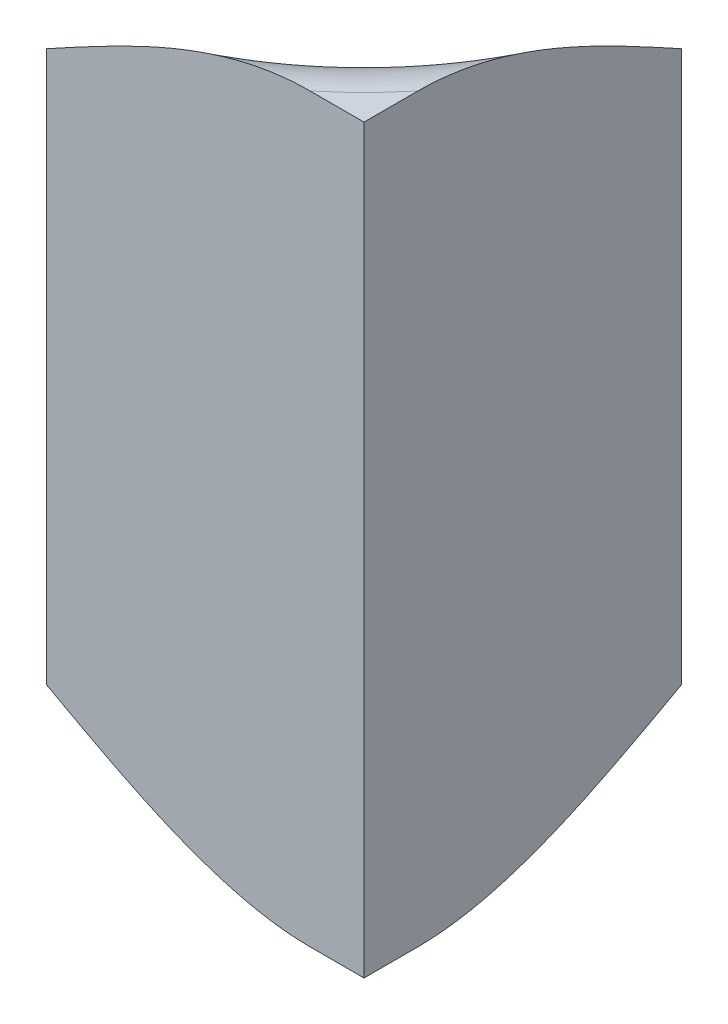
ISO-10303-21;
HEADER;
FILE_DESCRIPTION(('STEP AP214'),'2;1');
FILE_NAME('part.step','',(''),(''),'','','');
FILE_SCHEMA(('AUTOMOTIVE_DESIGN { 1 0 10303 214 1 1 1 1 }'));
ENDSEC;
DATA;
#1=APPLICATION_CONTEXT('core data for automotive mechanical design processes');
#2=APPLICATION_PROTOCOL_DEFINITION('international standard','automotive_design',2000,#1);
#3=PRODUCT_CONTEXT('',#1,'mechanical');
#4=PRODUCT('Part','Part','',(#3));
#5=PRODUCT_RELATED_PRODUCT_CATEGORY('part','',(#4));
#6=PRODUCT_DEFINITION_FORMATION('','',#4);
#7=PRODUCT_DEFINITION_CONTEXT('part definition',#1,'design');
#8=PRODUCT_DEFINITION('design','',#6,#7);
#9=PRODUCT_DEFINITION_SHAPE('','',#8);
#10=(LENGTH_UNIT() NAMED_UNIT(*) SI_UNIT(.MILLI.,.METRE.));
#11=(NAMED_UNIT(*) PLANE_ANGLE_UNIT() SI_UNIT($,.RADIAN.));
#12=(NAMED_UNIT(*) SI_UNIT($,.STERADIAN.) SOLID_ANGLE_UNIT());
#13=UNCERTAINTY_MEASURE_WITH_UNIT(LENGTH_MEASURE(1.E-05),#10,'distance_accuracy_value','');
#14=(GEOMETRIC_REPRESENTATION_CONTEXT(3) GLOBAL_UNCERTAINTY_ASSIGNED_CONTEXT((#13)) GLOBAL_UNIT_ASSIGNED_CONTEXT((#10,
#11,#12)) REPRESENTATION_CONTEXT('',''));
#15=CARTESIAN_POINT('',(0.,0.,0.));
#16=DIRECTION('',(0.,0.,1.));
#17=DIRECTION('',(1.,0.,0.));
#18=AXIS2_PLACEMENT_3D('',#15,#16,#17);
#19=CARTESIAN_POINT('',(-1.3,2.46,-7.3));
#20=DIRECTION('',(0.,1.,0.));
#21=DIRECTION('',(0.,0.,1.));
#22=AXIS2_PLACEMENT_3D('',#19,#20,#21);
#23=TOROIDAL_SURFACE('',#22,0.389999999999997,0.0899999999999994);
#24=CARTESIAN_POINT('',(-1.3,2.46,-7.3));
#25=DIRECTION('',(0.,1.,0.));
#26=DIRECTION('',(0.,0.,1.));
#27=AXIS2_PLACEMENT_3D('',#24,#25,#26);
#28=CIRCLE('',#27,0.299999999999999);
#29=CARTESIAN_POINT('',(-1.29999999999999,2.46,-7.));
#30=VERTEX_POINT('',#29);
#31=CARTESIAN_POINT('',(-1.,2.46,-7.30000000000001));
#32=VERTEX_POINT('',#31);
#33=EDGE_CURVE('E73',#30,#32,#28,.T.);
#34=ORIENTED_EDGE('',*,*,#33,.F.);
#35=CARTESIAN_POINT('',(-1.05080128411139,2.55,-7.));
#36=CARTESIAN_POINT('',(-1.06539050320357,2.54996873881583,-7.));
#37=CARTESIAN_POINT('',(-1.07987147393058,2.54856309488377,-7.));
#38=CARTESIAN_POINT('',(-1.10829216976644,2.54368423695863,-7.));
#39=CARTESIAN_POINT('',(-1.12223658857574,2.54023956259986,-7.));
#40=CARTESIAN_POINT('',(-1.16420253695043,2.52752219042687,-7.));
#41=CARTESIAN_POINT('',(-1.19147802039731,2.51594220810296,-7.));
#42=CARTESIAN_POINT('',(-1.24483565452284,2.49015615109011,-7.));
#43=CARTESIAN_POINT('',(-1.27090803790909,2.47593214013202,-7.));
#44=CARTESIAN_POINT('',(-1.29797451018032,2.46110939531162,-7.));
#45=CARTESIAN_POINT('',(-1.29898724918841,2.46055469450969,-7.));
#46=CARTESIAN_POINT('',(-1.3,2.46,-7.));
#47=B_SPLINE_CURVE_WITH_KNOTS('',3,(#35,#36,#37,#38,#39,#40,#41,#42,#43,#44,#45,#46),
.UNSPECIFIED.,.F.,.F.,(4,2,2,2,2,4),(0.,0.043552729593951,0.0865098187320547,0.17500096336578,
0.264115894109955,0.267579995726728),.UNSPECIFIED.);
#48=CARTESIAN_POINT('',(-1.05080128411192,2.55,-7.));
#49=VERTEX_POINT('',#48);
#50=EDGE_CURVE('E68',#49,#30,#47,.T.);
#51=ORIENTED_EDGE('',*,*,#50,.F.);
#52=CARTESIAN_POINT('',(-1.3,2.55,-7.3));
#53=DIRECTION('',(0.,1.,0.));
#54=DIRECTION('',(0.,0.,1.));
#55=AXIS2_PLACEMENT_3D('',#52,#53,#54);
#56=CIRCLE('',#55,0.389999999999999);
#57=CARTESIAN_POINT('',(-1.,2.55,-7.05080128411123));
#58=VERTEX_POINT('',#57);
#59=EDGE_CURVE('E21',#58,#49,#56,.F.);
#60=ORIENTED_EDGE('',*,*,#59,.F.);
#61=CARTESIAN_POINT('',(-1.,2.46,-7.3));
#62=CARTESIAN_POINT('',(-1.,2.46055469331151,-7.29898725661568));
#63=CARTESIAN_POINT('',(-1.,2.4611093941655,-7.2979745173251));
#64=CARTESIAN_POINT('',(-0.999999999999993,2.47615989168987,-7.27049202919079));
#65=CARTESIAN_POINT('',(-0.999999999999998,2.49061098047872,-7.24399834794997));
#66=CARTESIAN_POINT('',(-1.,2.51675946724614,-7.18967717491197));
#67=CARTESIAN_POINT('',(-1.,2.5284680600829,-7.16185568411195));
#68=CARTESIAN_POINT('',(-1.,2.54263860606329,-7.11373742133401));
#69=CARTESIAN_POINT('',(-1.,2.5468822855453,-7.09402727811996));
#70=CARTESIAN_POINT('',(-1.,2.54981614838478,-7.06402445895716));
#71=CARTESIAN_POINT('',(-1.,2.55021635400833,-7.05390597518064));
#72=CARTESIAN_POINT('',(-1.,2.5495579808952,-7.03370986034958));
#73=CARTESIAN_POINT('',(-1.,2.54850159887963,-7.02363219071494));
#74=CARTESIAN_POINT('',(-1.,2.54519918623927,-7.00684979518926));
#75=CARTESIAN_POINT('',(-1.,2.54341502426508,-7.00005494157829));
#76=CARTESIAN_POINT('',(-1.,2.53886646101216,-6.98679600381801));
#77=CARTESIAN_POINT('',(-1.,2.53610297225815,-6.9803316181373));
#78=CARTESIAN_POINT('',(-1.,2.53012138519624,-6.96914567585049));
#79=CARTESIAN_POINT('',(-1.,2.52708831558088,-6.96432582286341));
#80=CARTESIAN_POINT('',(-1.,2.52028079794343,-6.95523875596396));
#81=CARTESIAN_POINT('',(-1.,2.51650729299447,-6.95097085040484));
#82=CARTESIAN_POINT('',(-1.,2.50903441492666,-6.94395259376659));
#83=CARTESIAN_POINT('',(-1.,2.50546117484758,-6.94106831875637));
#84=CARTESIAN_POINT('',(-1.,2.49788615695021,-6.93592638908621));
#85=CARTESIAN_POINT('',(-1.,2.49388456239997,-6.93366846791901));
#86=CARTESIAN_POINT('',(-1.,2.48551161903108,-6.92989142890798));
#87=CARTESIAN_POINT('',(-1.,2.48113803302172,-6.928377215587));
#88=CARTESIAN_POINT('',(-1.,2.47218112849728,-6.92621203743497));
#89=CARTESIAN_POINT('',(-1.,2.46759791181043,-6.92556065799353));
#90=CARTESIAN_POINT('',(-1.,2.45891376678059,-6.92518958858274));
#91=CARTESIAN_POINT('',(-1.,2.45481671703712,-6.92537314245993));
#92=CARTESIAN_POINT('',(-1.,2.44671856100795,-6.9264439157805));
#93=CARTESIAN_POINT('',(-1.,2.44271739541585,-6.92733068805597));
#94=CARTESIAN_POINT('',(-1.,2.43501262320043,-6.92972859349772));
#95=CARTESIAN_POINT('',(-1.,2.43130422631035,-6.93122452010426));
#96=CARTESIAN_POINT('',(-1.,2.4241564129507,-6.93476988704399));
#97=CARTESIAN_POINT('',(-1.,2.42071747205478,-6.9368202788027));
#98=CARTESIAN_POINT('',(-1.,2.41386646883969,-6.94160127423581));
#99=CARTESIAN_POINT('',(-1.,2.41048640398363,-6.94437729315411));
#100=CARTESIAN_POINT('',(-1.,2.40416465676448,-6.950367674953));
#101=CARTESIAN_POINT('',(-1.,2.40122122144442,-6.95358018002081));
#102=CARTESIAN_POINT('',(-1.,2.39850407393578,-6.95696253280322));
#103=B_SPLINE_CURVE_WITH_KNOTS('',3,(#61,#62,#63,#64,#65,#66,#67,#68,#69,#70,#71,#72,#73,#74,
#75,#76,#77,#78,#79,#80,#81,#82,#83,#84,#85,#86,#87,#88,#89,#90,#91,#92,#93,#94,#95,#96,#97,#98,
#99,#100,#101,#102),.UNSPECIFIED.,.F.,.F.,(4,2,2,2,2,2,2,2,2,2,2,2,2,2,2,2,2,2,2,2,4),(0.,
0.00346410161608679,0.0940013231415321,0.184162267737807,0.244240211027959,0.274541767257781,
0.304797674801034,0.325813063735696,0.34680892205333,0.363831063314095,0.380831663025126,
0.394552608315547,0.408267706495772,0.422072076080112,0.435869809956181,0.448112045060008,
0.460346501713535,0.472292633881985,0.484259396344654,0.497334648987117,0.510355897946338),.UNSPECIFIED.);
#104=EDGE_CURVE('E65',#32,#58,#103,.T.);
#105=ORIENTED_EDGE('',*,*,#104,.F.);
#106=EDGE_LOOP('',(#34,#51,#60,#105));
#107=FACE_BOUND('',#106,.T.);
#108=ADVANCED_FACE('F17',(#107),#23,.T.);
#109=CARTESIAN_POINT('',(-1.3,1.94,-7.3));
#110=DIRECTION('',(0.,1.,0.));
#111=DIRECTION('',(-1.,0.,0.));
#112=AXIS2_PLACEMENT_3D('',#109,#110,#111);
#113=CYLINDRICAL_SURFACE('',#112,0.299999999999999);
#114=DIRECTION('',(0.,-1.,0.));
#115=VECTOR('',#114,1.);
#116=CARTESIAN_POINT('',(-1.3,2.20000000000024,-7.));
#117=LINE('',#116,#115);
#118=CARTESIAN_POINT('',(-1.3,1.94,-7.));
#119=VERTEX_POINT('',#118);
#120=EDGE_CURVE('E84',#30,#119,#117,.T.);
#121=ORIENTED_EDGE('',*,*,#120,.F.);
#122=ORIENTED_EDGE('',*,*,#33,.T.);
#123=DIRECTION('',(0.,1.,0.));
#124=VECTOR('',#123,1.);
#125=CARTESIAN_POINT('',(-1.,2.19999999999976,-7.3));
#126=LINE('',#125,#124);
#127=CARTESIAN_POINT('',(-1.,1.94,-7.3));
#128=VERTEX_POINT('',#127);
#129=EDGE_CURVE('E82',#128,#32,#126,.T.);
#130=ORIENTED_EDGE('',*,*,#129,.F.);
#131=CARTESIAN_POINT('',(-1.3,1.94,-7.3));
#132=DIRECTION('',(0.,1.,0.));
#133=DIRECTION('',(0.,0.,1.));
#134=AXIS2_PLACEMENT_3D('',#131,#132,#133);
#135=CIRCLE('',#134,0.299999999999999);
#136=EDGE_CURVE('E72',#119,#128,#135,.T.);
#137=ORIENTED_EDGE('',*,*,#136,.F.);
#138=EDGE_LOOP('',(#121,#122,#130,#137));
#139=FACE_BOUND('',#138,.T.);
#140=ADVANCED_FACE('F104',(#139),#113,.F.);
#141=CARTESIAN_POINT('',(-1.051801284111,2.55,-7.051801284111));
#142=DIRECTION('',(0.,1.,0.));
#143=DIRECTION('',(0.,0.,1.));
#144=AXIS2_PLACEMENT_3D('',#141,#142,#143);
#145=PLANE('',#144);
#146=DIRECTION('',(-1.,0.,0.));
#147=VECTOR('',#146,1.);
#148=CARTESIAN_POINT('',(-1.15,2.55,-7.));
#149=LINE('',#148,#147);
#150=CARTESIAN_POINT('',(-1.,2.55,-7.));
#151=VERTEX_POINT('',#150);
#152=EDGE_CURVE('E76',#151,#49,#149,.T.);
#153=ORIENTED_EDGE('',*,*,#152,.F.);
#154=DIRECTION('',(0.,0.,1.));
#155=VECTOR('',#154,1.);
#156=CARTESIAN_POINT('',(-1.,2.55,-7.15));
#157=LINE('',#156,#155);
#158=EDGE_CURVE('E74',#58,#151,#157,.T.);
#159=ORIENTED_EDGE('',*,*,#158,.F.);
#160=ORIENTED_EDGE('',*,*,#59,.T.);
#161=EDGE_LOOP('',(#153,#159,#160));
#162=FACE_BOUND('',#161,.T.);
#163=ADVANCED_FACE('F75',(#162),#145,.T.);
#164=CARTESIAN_POINT('',(-1.3,1.94,-7.3));
#165=DIRECTION('',(0.,-1.,0.));
#166=DIRECTION('',(0.,0.,-1.));
#167=AXIS2_PLACEMENT_3D('',#164,#165,#166);
#168=TOROIDAL_SURFACE('',#167,0.389999999999999,0.0899999999999996);
#169=CARTESIAN_POINT('',(-1.3,1.85,-7.3));
#170=DIRECTION('',(0.,-1.,0.));
#171=DIRECTION('',(0.,0.,-1.));
#172=AXIS2_PLACEMENT_3D('',#169,#170,#171);
#173=CIRCLE('',#172,0.39);
#174=CARTESIAN_POINT('',(-1.05080128411173,1.85,-7.0000000000006));
#175=VERTEX_POINT('',#174);
#176=CARTESIAN_POINT('',(-1.,1.85,-7.05080128411192));
#177=VERTEX_POINT('',#176);
#178=EDGE_CURVE('E121',#175,#177,#173,.F.);
#179=ORIENTED_EDGE('',*,*,#178,.F.);
#180=CARTESIAN_POINT('',(-1.05080128411139,1.85,-7.));
#181=CARTESIAN_POINT('',(-1.06539050320357,1.85003126118417,-7.));
#182=CARTESIAN_POINT('',(-1.07987147393057,1.85143690511623,-7.));
#183=CARTESIAN_POINT('',(-1.10829216976644,1.85631576304136,-7.));
#184=CARTESIAN_POINT('',(-1.12223658857574,1.85976043740014,-7.));
#185=CARTESIAN_POINT('',(-1.16420253695043,1.87247780957314,-7.));
#186=CARTESIAN_POINT('',(-1.19147802039731,1.88405779189706,-7.));
#187=CARTESIAN_POINT('',(-1.24483565452285,1.90984384890988,-7.));
#188=CARTESIAN_POINT('',(-1.27090803790913,1.92406785986791,-7.));
#189=CARTESIAN_POINT('',(-1.29797451018032,1.93889060468837,-7.));
#190=CARTESIAN_POINT('',(-1.29898724918842,1.93944530549031,-7.));
#191=CARTESIAN_POINT('',(-1.3,1.94,-7.));
#192=B_SPLINE_CURVE_WITH_KNOTS('',3,(#180,#181,#182,#183,#184,#185,#186,#187,#188,#189,#190,
#191),.UNSPECIFIED.,.F.,.F.,(4,2,2,2,2,4),(0.,0.0435527295939442,0.0865098187320552,
0.175000963365784,0.264115894109956,0.267579995726729),.UNSPECIFIED.);
#193=EDGE_CURVE('E115',#119,#175,#192,.F.);
#194=ORIENTED_EDGE('',*,*,#193,.F.);
#195=ORIENTED_EDGE('',*,*,#136,.T.);
#196=CARTESIAN_POINT('',(-1.,1.85,-7.05080128411138));
#197=CARTESIAN_POINT('',(-1.,1.85003126118416,-7.06539050320358));
#198=CARTESIAN_POINT('',(-1.,1.85143690511622,-7.07987147393059));
#199=CARTESIAN_POINT('',(-1.,1.85631576304137,-7.10829216976645));
#200=CARTESIAN_POINT('',(-1.,1.85976043740014,-7.12223658857575));
#201=CARTESIAN_POINT('',(-1.,1.87247780957312,-7.16420253695043));
#202=CARTESIAN_POINT('',(-1.,1.884057791897,-7.19147802039733));
#203=CARTESIAN_POINT('',(-1.,1.90984384890993,-7.24483565452281));
#204=CARTESIAN_POINT('',(-1.,1.92406785986814,-7.270908037909));
#205=CARTESIAN_POINT('',(-1.,1.93889060468839,-7.29797451018031));
#206=CARTESIAN_POINT('',(-1.,1.93944530549032,-7.29898724918841));
#207=CARTESIAN_POINT('',(-1.,1.94,-7.3));
#208=B_SPLINE_CURVE_WITH_KNOTS('',3,(#196,#197,#198,#199,#200,#201,#202,#203,#204,#205,#206,
#207),.UNSPECIFIED.,.F.,.F.,(4,2,2,2,2,4),(0.,0.0435527295939683,0.0865098187320563,
0.17500096336577,0.264115894109956,0.267579995726729),.UNSPECIFIED.);
#209=EDGE_CURVE('E77',#177,#128,#208,.T.);
#210=ORIENTED_EDGE('',*,*,#209,.F.);
#211=EDGE_LOOP('',(#179,#194,#195,#210));
#212=FACE_BOUND('',#211,.T.);
#213=ADVANCED_FACE('F110',(#212),#168,.T.);
#214=CARTESIAN_POINT('',(-1.,2.55100000000047,-6.999));
#215=DIRECTION('',(1.,0.,0.));
#216=DIRECTION('',(0.,-1.,0.));
#217=AXIS2_PLACEMENT_3D('',#214,#215,#216);
#218=PLANE('',#217);
#219=ORIENTED_EDGE('',*,*,#129,.T.);
#220=ORIENTED_EDGE('',*,*,#104,.T.);
#221=ORIENTED_EDGE('',*,*,#158,.T.);
#222=DIRECTION('',(0.,1.,0.));
#223=VECTOR('',#222,1.);
#224=CARTESIAN_POINT('',(-1.,2.20000000000024,-7.));
#225=LINE('',#224,#223);
#226=CARTESIAN_POINT('',(-1.,1.85,-7.));
#227=VERTEX_POINT('',#226);
#228=EDGE_CURVE('E36',#227,#151,#225,.T.);
#229=ORIENTED_EDGE('',*,*,#228,.F.);
#230=DIRECTION('',(0.,0.,1.));
#231=VECTOR('',#230,1.);
#232=CARTESIAN_POINT('',(-1.,1.85,-7.0254006420555));
#233=LINE('',#232,#231);
#234=EDGE_CURVE('E27',#177,#227,#233,.T.);
#235=ORIENTED_EDGE('',*,*,#234,.F.);
#236=ORIENTED_EDGE('',*,*,#209,.T.);
#237=EDGE_LOOP('',(#219,#220,#221,#229,#235,#236));
#238=FACE_BOUND('',#237,.T.);
#239=ADVANCED_FACE('F79',(#238),#218,.T.);
#240=CARTESIAN_POINT('',(-1.301,2.55100000000095,-7.));
#241=DIRECTION('',(0.,0.,1.));
#242=DIRECTION('',(0.,-1.,0.));
#243=AXIS2_PLACEMENT_3D('',#240,#241,#242);
#244=PLANE('',#243);
#245=ORIENTED_EDGE('',*,*,#228,.T.);
#246=ORIENTED_EDGE('',*,*,#152,.T.);
#247=ORIENTED_EDGE('',*,*,#50,.T.);
#248=ORIENTED_EDGE('',*,*,#120,.T.);
#249=ORIENTED_EDGE('',*,*,#193,.T.);
#250=DIRECTION('',(-1.,0.,0.));
#251=VECTOR('',#250,1.);
#252=CARTESIAN_POINT('',(-1.0254006420555,1.85,-7.));
#253=LINE('',#252,#251);
#254=EDGE_CURVE('E11',#227,#175,#253,.T.);
#255=ORIENTED_EDGE('',*,*,#254,.F.);
#256=EDGE_LOOP('',(#245,#246,#247,#248,#249,#255));
#257=FACE_BOUND('',#256,.T.);
#258=ADVANCED_FACE('F123',(#257),#244,.T.);
#259=CARTESIAN_POINT('',(-1.051801284111,1.85,-6.999));
#260=DIRECTION('',(0.,-1.,0.));
#261=DIRECTION('',(0.,0.,-1.));
#262=AXIS2_PLACEMENT_3D('',#259,#260,#261);
#263=PLANE('',#262);
#264=ORIENTED_EDGE('',*,*,#234,.T.);
#265=ORIENTED_EDGE('',*,*,#254,.T.);
#266=ORIENTED_EDGE('',*,*,#178,.T.);
#267=EDGE_LOOP('',(#264,#265,#266));
#268=FACE_BOUND('',#267,.T.);
#269=ADVANCED_FACE('F19',(#268),#263,.T.);
#270=CLOSED_SHELL('',(#108,#140,#163,#213,#239,#258,#269));
#271=MANIFOLD_SOLID_BREP('B1',#270);
#272=ADVANCED_BREP_SHAPE_REPRESENTATION('',(#18,#271),#14);
#273=SHAPE_DEFINITION_REPRESENTATION(#9,#272);
ENDSEC;
END-ISO-10303-21;
